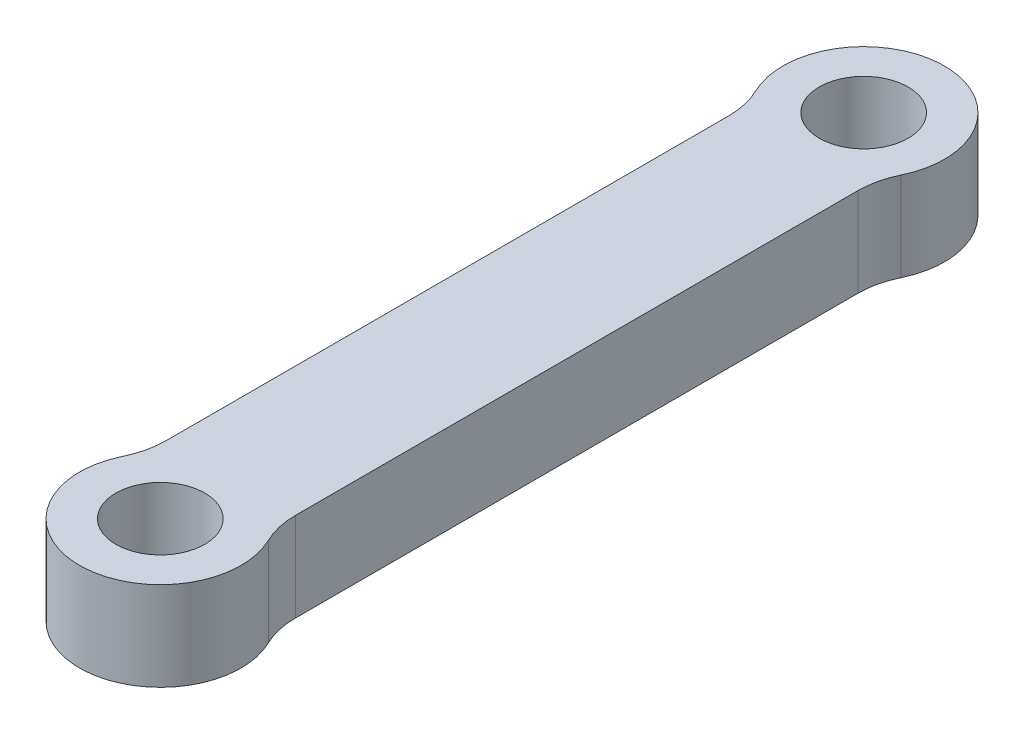
ISO-10303-21;
HEADER;
FILE_DESCRIPTION(('STEP AP214'),'2;1');
FILE_NAME('part.step','',(''),(''),'','','');
FILE_SCHEMA(('AUTOMOTIVE_DESIGN { 1 0 10303 214 1 1 1 1 }'));
ENDSEC;
DATA;
#1=APPLICATION_CONTEXT('core data for automotive mechanical design processes');
#2=APPLICATION_PROTOCOL_DEFINITION('international standard','automotive_design',2000,#1);
#3=PRODUCT_CONTEXT('',#1,'mechanical');
#4=PRODUCT('Part','Part','',(#3));
#5=PRODUCT_RELATED_PRODUCT_CATEGORY('part','',(#4));
#6=PRODUCT_DEFINITION_FORMATION('','',#4);
#7=PRODUCT_DEFINITION_CONTEXT('part definition',#1,'design');
#8=PRODUCT_DEFINITION('design','',#6,#7);
#9=PRODUCT_DEFINITION_SHAPE('','',#8);
#10=(LENGTH_UNIT() NAMED_UNIT(*) SI_UNIT(.MILLI.,.METRE.));
#11=(NAMED_UNIT(*) PLANE_ANGLE_UNIT() SI_UNIT($,.RADIAN.));
#12=(NAMED_UNIT(*) SI_UNIT($,.STERADIAN.) SOLID_ANGLE_UNIT());
#13=UNCERTAINTY_MEASURE_WITH_UNIT(LENGTH_MEASURE(1.E-05),#10,'distance_accuracy_value','');
#14=(GEOMETRIC_REPRESENTATION_CONTEXT(3) GLOBAL_UNCERTAINTY_ASSIGNED_CONTEXT((#13)) GLOBAL_UNIT_ASSIGNED_CONTEXT((#10,
#11,#12)) REPRESENTATION_CONTEXT('',''));
#15=CARTESIAN_POINT('',(0.,0.,0.));
#16=DIRECTION('',(0.,0.,1.));
#17=DIRECTION('',(1.,0.,0.));
#18=AXIS2_PLACEMENT_3D('',#15,#16,#17);
#19=CARTESIAN_POINT('',(-3.99999999999999,5.5,21.75));
#20=DIRECTION('',(1.,0.,0.));
#21=DIRECTION('',(0.,0.,-1.));
#22=AXIS2_PLACEMENT_3D('',#19,#20,#21);
#23=PLANE('',#22);
#24=DIRECTION('',(0.,0.,1.));
#25=VECTOR('',#24,1.);
#26=CARTESIAN_POINT('',(-3.99999999999999,0.,21.75));
#27=LINE('',#26,#25);
#28=CARTESIAN_POINT('',(-3.99999999999999,0.,-17.3911010564593));
#29=VERTEX_POINT('',#28);
#30=CARTESIAN_POINT('',(-3.99999999999999,0.,17.3911010564593));
#31=VERTEX_POINT('',#30);
#32=EDGE_CURVE('E108',#29,#31,#27,.T.);
#33=ORIENTED_EDGE('',*,*,#32,.T.);
#34=DIRECTION('',(0.,1.,0.));
#35=VECTOR('',#34,1.);
#36=CARTESIAN_POINT('',(-3.99999999999999,5.5,17.3911010564593));
#37=LINE('',#36,#35);
#38=CARTESIAN_POINT('',(-3.99999999999999,5.5,17.3911010564593));
#39=VERTEX_POINT('',#38);
#40=EDGE_CURVE('E112',#31,#39,#37,.T.);
#41=ORIENTED_EDGE('',*,*,#40,.T.);
#42=DIRECTION('',(0.,0.,1.));
#43=VECTOR('',#42,1.);
#44=CARTESIAN_POINT('',(-3.99999999999999,5.5,21.75));
#45=LINE('',#44,#43);
#46=CARTESIAN_POINT('',(-3.99999999999999,5.5,-17.3911010564593));
#47=VERTEX_POINT('',#46);
#48=EDGE_CURVE('E111',#47,#39,#45,.T.);
#49=ORIENTED_EDGE('',*,*,#48,.F.);
#50=DIRECTION('',(0.,1.,0.));
#51=VECTOR('',#50,1.);
#52=CARTESIAN_POINT('',(-3.99999999999999,5.5,-17.3911010564593));
#53=LINE('',#52,#51);
#54=EDGE_CURVE('E101',#47,#29,#53,.F.);
#55=ORIENTED_EDGE('',*,*,#54,.T.);
#56=EDGE_LOOP('',(#33,#41,#49,#55));
#57=FACE_BOUND('',#56,.T.);
#58=ADVANCED_FACE('F35',(#57),#23,.F.);
#59=CARTESIAN_POINT('',(4.,5.5,21.75));
#60=DIRECTION('',(-1.,0.,0.));
#61=DIRECTION('',(0.,0.,1.));
#62=AXIS2_PLACEMENT_3D('',#59,#60,#61);
#63=PLANE('',#62);
#64=DIRECTION('',(0.,0.,-1.));
#65=VECTOR('',#64,1.);
#66=CARTESIAN_POINT('',(4.,5.5,21.75));
#67=LINE('',#66,#65);
#68=CARTESIAN_POINT('',(4.,5.5,17.3911010564593));
#69=VERTEX_POINT('',#68);
#70=CARTESIAN_POINT('',(4.,5.5,-17.3911010564593));
#71=VERTEX_POINT('',#70);
#72=EDGE_CURVE('E113',#69,#71,#67,.T.);
#73=ORIENTED_EDGE('',*,*,#72,.F.);
#74=DIRECTION('',(0.,1.,0.));
#75=VECTOR('',#74,1.);
#76=CARTESIAN_POINT('',(4.,5.5,17.3911010564593));
#77=LINE('',#76,#75);
#78=CARTESIAN_POINT('',(4.,0.,17.3911010564593));
#79=VERTEX_POINT('',#78);
#80=EDGE_CURVE('E140',#69,#79,#77,.F.);
#81=ORIENTED_EDGE('',*,*,#80,.T.);
#82=DIRECTION('',(0.,0.,-1.));
#83=VECTOR('',#82,1.);
#84=CARTESIAN_POINT('',(4.,0.,21.75));
#85=LINE('',#84,#83);
#86=CARTESIAN_POINT('',(4.,0.,-17.3911010564593));
#87=VERTEX_POINT('',#86);
#88=EDGE_CURVE('E121',#79,#87,#85,.T.);
#89=ORIENTED_EDGE('',*,*,#88,.T.);
#90=DIRECTION('',(0.,1.,0.));
#91=VECTOR('',#90,1.);
#92=CARTESIAN_POINT('',(4.,5.5,-17.3911010564593));
#93=LINE('',#92,#91);
#94=EDGE_CURVE('E137',#87,#71,#93,.T.);
#95=ORIENTED_EDGE('',*,*,#94,.T.);
#96=EDGE_LOOP('',(#73,#81,#89,#95));
#97=FACE_BOUND('',#96,.T.);
#98=ADVANCED_FACE('F160',(#97),#63,.F.);
#99=CARTESIAN_POINT('',(0.,5.5,-21.75));
#100=DIRECTION('',(0.,1.,0.));
#101=DIRECTION('',(0.,0.,1.));
#102=AXIS2_PLACEMENT_3D('',#99,#100,#101);
#103=PLANE('',#102);
#104=CARTESIAN_POINT('',(0.,5.5,-21.75));
#105=DIRECTION('',(0.,1.,0.));
#106=DIRECTION('',(0.,0.,1.));
#107=AXIS2_PLACEMENT_3D('',#104,#105,#106);
#108=CIRCLE('',#107,5.);
#109=CARTESIAN_POINT('',(4.5,5.5,-19.5705505282296));
#110=VERTEX_POINT('',#109);
#111=CARTESIAN_POINT('',(-4.5,5.5,-19.5705505282296));
#112=VERTEX_POINT('',#111);
#113=EDGE_CURVE('E168',#110,#112,#108,.T.);
#114=ORIENTED_EDGE('',*,*,#113,.T.);
#115=CARTESIAN_POINT('',(-8.99999999999999,5.5,-17.3911010564593));
#116=DIRECTION('',(0.,1.,0.));
#117=DIRECTION('',(0.,0.,1.));
#118=AXIS2_PLACEMENT_3D('',#115,#116,#117);
#119=CIRCLE('',#118,5.);
#120=EDGE_CURVE('E11',#112,#47,#119,.F.);
#121=ORIENTED_EDGE('',*,*,#120,.T.);
#122=ORIENTED_EDGE('',*,*,#48,.T.);
#123=CARTESIAN_POINT('',(-8.99999999999999,5.5,17.3911010564593));
#124=DIRECTION('',(0.,1.,0.));
#125=DIRECTION('',(0.,0.,1.));
#126=AXIS2_PLACEMENT_3D('',#123,#124,#125);
#127=CIRCLE('',#126,5.);
#128=CARTESIAN_POINT('',(-4.5,5.5,19.5705505282296));
#129=VERTEX_POINT('',#128);
#130=EDGE_CURVE('E145',#39,#129,#127,.F.);
#131=ORIENTED_EDGE('',*,*,#130,.T.);
#132=CARTESIAN_POINT('',(0.,5.5,21.75));
#133=DIRECTION('',(0.,1.,0.));
#134=DIRECTION('',(0.,0.,-1.));
#135=AXIS2_PLACEMENT_3D('',#132,#133,#134);
#136=CIRCLE('',#135,5.);
#137=CARTESIAN_POINT('',(4.5,5.5,19.5705505282296));
#138=VERTEX_POINT('',#137);
#139=EDGE_CURVE('E174',#129,#138,#136,.T.);
#140=ORIENTED_EDGE('',*,*,#139,.T.);
#141=CARTESIAN_POINT('',(9.,5.5,17.3911010564593));
#142=DIRECTION('',(0.,1.,0.));
#143=DIRECTION('',(0.,0.,1.));
#144=AXIS2_PLACEMENT_3D('',#141,#142,#143);
#145=CIRCLE('',#144,5.);
#146=EDGE_CURVE('E150',#138,#69,#145,.F.);
#147=ORIENTED_EDGE('',*,*,#146,.T.);
#148=ORIENTED_EDGE('',*,*,#72,.T.);
#149=CARTESIAN_POINT('',(9.,5.5,-17.3911010564593));
#150=DIRECTION('',(0.,1.,0.));
#151=DIRECTION('',(0.,0.,1.));
#152=AXIS2_PLACEMENT_3D('',#149,#150,#151);
#153=CIRCLE('',#152,5.);
#154=EDGE_CURVE('E152',#71,#110,#153,.F.);
#155=ORIENTED_EDGE('',*,*,#154,.T.);
#156=EDGE_LOOP('',(#114,#121,#122,#131,#140,#147,#148,#155));
#157=FACE_BOUND('',#156,.T.);
#158=CARTESIAN_POINT('',(0.,5.5,-21.75));
#159=DIRECTION('',(0.,1.,0.));
#160=DIRECTION('',(0.,0.,1.));
#161=AXIS2_PLACEMENT_3D('',#158,#159,#160);
#162=CIRCLE('',#161,2.75);
#163=CARTESIAN_POINT('',(0.,5.5,-19.));
#164=VERTEX_POINT('',#163);
#165=EDGE_CURVE('E127',#164,#164,#162,.T.);
#166=ORIENTED_EDGE('',*,*,#165,.F.);
#167=EDGE_LOOP('',(#166));
#168=FACE_BOUND('',#167,.T.);
#169=CARTESIAN_POINT('',(0.,5.5,21.75));
#170=DIRECTION('',(0.,1.,0.));
#171=DIRECTION('',(0.,0.,1.));
#172=AXIS2_PLACEMENT_3D('',#169,#170,#171);
#173=CIRCLE('',#172,2.75);
#174=CARTESIAN_POINT('',(0.,5.5,24.5));
#175=VERTEX_POINT('',#174);
#176=EDGE_CURVE('E172',#175,#175,#173,.T.);
#177=ORIENTED_EDGE('',*,*,#176,.F.);
#178=EDGE_LOOP('',(#177));
#179=FACE_BOUND('',#178,.T.);
#180=ADVANCED_FACE('F166',(#157,#168,#179),#103,.T.);
#181=CARTESIAN_POINT('',(0.,0.,-21.75));
#182=DIRECTION('',(0.,1.,0.));
#183=DIRECTION('',(0.,0.,1.));
#184=AXIS2_PLACEMENT_3D('',#181,#182,#183);
#185=PLANE('',#184);
#186=ORIENTED_EDGE('',*,*,#88,.F.);
#187=CARTESIAN_POINT('',(9.,0.,17.3911010564593));
#188=DIRECTION('',(0.,1.,0.));
#189=DIRECTION('',(0.,0.,1.));
#190=AXIS2_PLACEMENT_3D('',#187,#188,#189);
#191=CIRCLE('',#190,5.);
#192=CARTESIAN_POINT('',(4.5,0.,19.5705505282296));
#193=VERTEX_POINT('',#192);
#194=EDGE_CURVE('E148',#79,#193,#191,.T.);
#195=ORIENTED_EDGE('',*,*,#194,.T.);
#196=CARTESIAN_POINT('',(0.,0.,21.75));
#197=DIRECTION('',(0.,1.,0.));
#198=DIRECTION('',(0.,0.,1.));
#199=AXIS2_PLACEMENT_3D('',#196,#197,#198);
#200=CIRCLE('',#199,5.);
#201=CARTESIAN_POINT('',(-4.5,0.,19.5705505282296));
#202=VERTEX_POINT('',#201);
#203=EDGE_CURVE('E170',#193,#202,#200,.F.);
#204=ORIENTED_EDGE('',*,*,#203,.T.);
#205=CARTESIAN_POINT('',(-8.99999999999999,0.,17.3911010564593));
#206=DIRECTION('',(0.,1.,0.));
#207=DIRECTION('',(0.,0.,1.));
#208=AXIS2_PLACEMENT_3D('',#205,#206,#207);
#209=CIRCLE('',#208,5.);
#210=EDGE_CURVE('E120',#202,#31,#209,.T.);
#211=ORIENTED_EDGE('',*,*,#210,.T.);
#212=ORIENTED_EDGE('',*,*,#32,.F.);
#213=CARTESIAN_POINT('',(-8.99999999999999,0.,-17.3911010564593));
#214=DIRECTION('',(0.,1.,0.));
#215=DIRECTION('',(0.,0.,1.));
#216=AXIS2_PLACEMENT_3D('',#213,#214,#215);
#217=CIRCLE('',#216,5.);
#218=CARTESIAN_POINT('',(-4.5,0.,-19.5705505282296));
#219=VERTEX_POINT('',#218);
#220=EDGE_CURVE('E43',#29,#219,#217,.T.);
#221=ORIENTED_EDGE('',*,*,#220,.T.);
#222=CARTESIAN_POINT('',(0.,0.,-21.75));
#223=DIRECTION('',(0.,1.,0.));
#224=DIRECTION('',(0.,0.,1.));
#225=AXIS2_PLACEMENT_3D('',#222,#223,#224);
#226=CIRCLE('',#225,5.);
#227=CARTESIAN_POINT('',(4.5,0.,-19.5705505282296));
#228=VERTEX_POINT('',#227);
#229=EDGE_CURVE('E155',#219,#228,#226,.F.);
#230=ORIENTED_EDGE('',*,*,#229,.T.);
#231=CARTESIAN_POINT('',(9.,0.,-17.3911010564593));
#232=DIRECTION('',(0.,1.,0.));
#233=DIRECTION('',(0.,0.,1.));
#234=AXIS2_PLACEMENT_3D('',#231,#232,#233);
#235=CIRCLE('',#234,5.);
#236=EDGE_CURVE('E103',#228,#87,#235,.T.);
#237=ORIENTED_EDGE('',*,*,#236,.T.);
#238=EDGE_LOOP('',(#186,#195,#204,#211,#212,#221,#230,#237));
#239=FACE_BOUND('',#238,.T.);
#240=CARTESIAN_POINT('',(0.,0.,-21.75));
#241=DIRECTION('',(0.,1.,0.));
#242=DIRECTION('',(0.,0.,1.));
#243=AXIS2_PLACEMENT_3D('',#240,#241,#242);
#244=CIRCLE('',#243,2.75);
#245=CARTESIAN_POINT('',(0.,0.,-19.));
#246=VERTEX_POINT('',#245);
#247=EDGE_CURVE('E122',#246,#246,#244,.T.);
#248=ORIENTED_EDGE('',*,*,#247,.T.);
#249=EDGE_LOOP('',(#248));
#250=FACE_BOUND('',#249,.T.);
#251=CARTESIAN_POINT('',(0.,0.,21.75));
#252=DIRECTION('',(0.,1.,0.));
#253=DIRECTION('',(0.,0.,1.));
#254=AXIS2_PLACEMENT_3D('',#251,#252,#253);
#255=CIRCLE('',#254,2.75);
#256=CARTESIAN_POINT('',(0.,0.,24.5));
#257=VERTEX_POINT('',#256);
#258=EDGE_CURVE('E180',#257,#257,#255,.T.);
#259=ORIENTED_EDGE('',*,*,#258,.T.);
#260=EDGE_LOOP('',(#259));
#261=FACE_BOUND('',#260,.T.);
#262=ADVANCED_FACE('F116',(#239,#250,#261),#185,.F.);
#263=CARTESIAN_POINT('',(0.,0.,21.75));
#264=DIRECTION('',(0.,1.,0.));
#265=DIRECTION('',(0.,0.,1.));
#266=AXIS2_PLACEMENT_3D('',#263,#264,#265);
#267=CYLINDRICAL_SURFACE('',#266,2.75);
#268=ORIENTED_EDGE('',*,*,#258,.F.);
#269=EDGE_LOOP('',(#268));
#270=FACE_BOUND('',#269,.T.);
#271=ORIENTED_EDGE('',*,*,#176,.T.);
#272=EDGE_LOOP('',(#271));
#273=FACE_BOUND('',#272,.T.);
#274=ADVANCED_FACE('F213',(#270,#273),#267,.F.);
#275=CARTESIAN_POINT('',(0.,0.,-21.75));
#276=DIRECTION('',(0.,1.,0.));
#277=DIRECTION('',(0.,0.,1.));
#278=AXIS2_PLACEMENT_3D('',#275,#276,#277);
#279=CYLINDRICAL_SURFACE('',#278,2.75);
#280=ORIENTED_EDGE('',*,*,#247,.F.);
#281=EDGE_LOOP('',(#280));
#282=FACE_BOUND('',#281,.T.);
#283=ORIENTED_EDGE('',*,*,#165,.T.);
#284=EDGE_LOOP('',(#283));
#285=FACE_BOUND('',#284,.T.);
#286=ADVANCED_FACE('F218',(#282,#285),#279,.F.);
#287=CARTESIAN_POINT('',(0.,-14.142135623731,-21.75));
#288=DIRECTION('',(0.,1.,0.));
#289=DIRECTION('',(0.,0.,1.));
#290=AXIS2_PLACEMENT_3D('',#287,#288,#289);
#291=CYLINDRICAL_SURFACE('',#290,5.);
#292=ORIENTED_EDGE('',*,*,#113,.F.);
#293=DIRECTION('',(0.,1.,0.));
#294=VECTOR('',#293,1.);
#295=CARTESIAN_POINT('',(4.5,-14.142135623731,-19.5705505282296));
#296=LINE('',#295,#294);
#297=EDGE_CURVE('E50',#110,#228,#296,.F.);
#298=ORIENTED_EDGE('',*,*,#297,.T.);
#299=ORIENTED_EDGE('',*,*,#229,.F.);
#300=DIRECTION('',(0.,1.,0.));
#301=VECTOR('',#300,1.);
#302=CARTESIAN_POINT('',(-4.5,-14.142135623731,-19.5705505282296));
#303=LINE('',#302,#301);
#304=EDGE_CURVE('E102',#219,#112,#303,.T.);
#305=ORIENTED_EDGE('',*,*,#304,.T.);
#306=EDGE_LOOP('',(#292,#298,#299,#305));
#307=FACE_BOUND('',#306,.T.);
#308=ADVANCED_FACE('F169',(#307),#291,.T.);
#309=CARTESIAN_POINT('',(0.,-14.142135623731,21.75));
#310=DIRECTION('',(0.,1.,0.));
#311=DIRECTION('',(0.,0.,1.));
#312=AXIS2_PLACEMENT_3D('',#309,#310,#311);
#313=CYLINDRICAL_SURFACE('',#312,5.);
#314=ORIENTED_EDGE('',*,*,#139,.F.);
#315=DIRECTION('',(0.,1.,0.));
#316=VECTOR('',#315,1.);
#317=CARTESIAN_POINT('',(-4.5,-14.142135623731,19.5705505282296));
#318=LINE('',#317,#316);
#319=EDGE_CURVE('E135',#129,#202,#318,.F.);
#320=ORIENTED_EDGE('',*,*,#319,.T.);
#321=ORIENTED_EDGE('',*,*,#203,.F.);
#322=DIRECTION('',(0.,1.,0.));
#323=VECTOR('',#322,1.);
#324=CARTESIAN_POINT('',(4.5,-14.142135623731,19.5705505282296));
#325=LINE('',#324,#323);
#326=EDGE_CURVE('E133',#193,#138,#325,.T.);
#327=ORIENTED_EDGE('',*,*,#326,.T.);
#328=EDGE_LOOP('',(#314,#320,#321,#327));
#329=FACE_BOUND('',#328,.T.);
#330=ADVANCED_FACE('F190',(#329),#313,.T.);
#331=CARTESIAN_POINT('',(-8.99999999999999,-14.142135623731,17.3911010564593));
#332=DIRECTION('',(0.,1.,0.));
#333=DIRECTION('',(0.,0.,1.));
#334=AXIS2_PLACEMENT_3D('',#331,#332,#333);
#335=CYLINDRICAL_SURFACE('',#334,5.);
#336=ORIENTED_EDGE('',*,*,#210,.F.);
#337=ORIENTED_EDGE('',*,*,#319,.F.);
#338=ORIENTED_EDGE('',*,*,#130,.F.);
#339=ORIENTED_EDGE('',*,*,#40,.F.);
#340=EDGE_LOOP('',(#336,#337,#338,#339));
#341=FACE_BOUND('',#340,.T.);
#342=ADVANCED_FACE('F193',(#341),#335,.F.);
#343=CARTESIAN_POINT('',(9.,-14.142135623731,17.3911010564593));
#344=DIRECTION('',(0.,1.,0.));
#345=DIRECTION('',(0.,0.,1.));
#346=AXIS2_PLACEMENT_3D('',#343,#344,#345);
#347=CYLINDRICAL_SURFACE('',#346,5.);
#348=ORIENTED_EDGE('',*,*,#146,.F.);
#349=ORIENTED_EDGE('',*,*,#326,.F.);
#350=ORIENTED_EDGE('',*,*,#194,.F.);
#351=ORIENTED_EDGE('',*,*,#80,.F.);
#352=EDGE_LOOP('',(#348,#349,#350,#351));
#353=FACE_BOUND('',#352,.T.);
#354=ADVANCED_FACE('F195',(#353),#347,.F.);
#355=CARTESIAN_POINT('',(9.,-14.142135623731,-17.3911010564593));
#356=DIRECTION('',(0.,1.,0.));
#357=DIRECTION('',(0.,0.,1.));
#358=AXIS2_PLACEMENT_3D('',#355,#356,#357);
#359=CYLINDRICAL_SURFACE('',#358,5.);
#360=ORIENTED_EDGE('',*,*,#236,.F.);
#361=ORIENTED_EDGE('',*,*,#297,.F.);
#362=ORIENTED_EDGE('',*,*,#154,.F.);
#363=ORIENTED_EDGE('',*,*,#94,.F.);
#364=EDGE_LOOP('',(#360,#361,#362,#363));
#365=FACE_BOUND('',#364,.T.);
#366=ADVANCED_FACE('F163',(#365),#359,.F.);
#367=CARTESIAN_POINT('',(-8.99999999999999,-14.142135623731,-17.3911010564593));
#368=DIRECTION('',(0.,1.,0.));
#369=DIRECTION('',(0.,0.,1.));
#370=AXIS2_PLACEMENT_3D('',#367,#368,#369);
#371=CYLINDRICAL_SURFACE('',#370,5.);
#372=ORIENTED_EDGE('',*,*,#120,.F.);
#373=ORIENTED_EDGE('',*,*,#304,.F.);
#374=ORIENTED_EDGE('',*,*,#220,.F.);
#375=ORIENTED_EDGE('',*,*,#54,.F.);
#376=EDGE_LOOP('',(#372,#373,#374,#375));
#377=FACE_BOUND('',#376,.T.);
#378=ADVANCED_FACE('F37',(#377),#371,.F.);
#379=CLOSED_SHELL('',(#58,#98,#180,#262,#274,#286,#308,#330,#342,#354,#366,#378));
#380=MANIFOLD_SOLID_BREP('B2',#379);
#381=ADVANCED_BREP_SHAPE_REPRESENTATION('',(#18,#380),#14);
#382=SHAPE_DEFINITION_REPRESENTATION(#9,#381);
ENDSEC;
END-ISO-10303-21;
